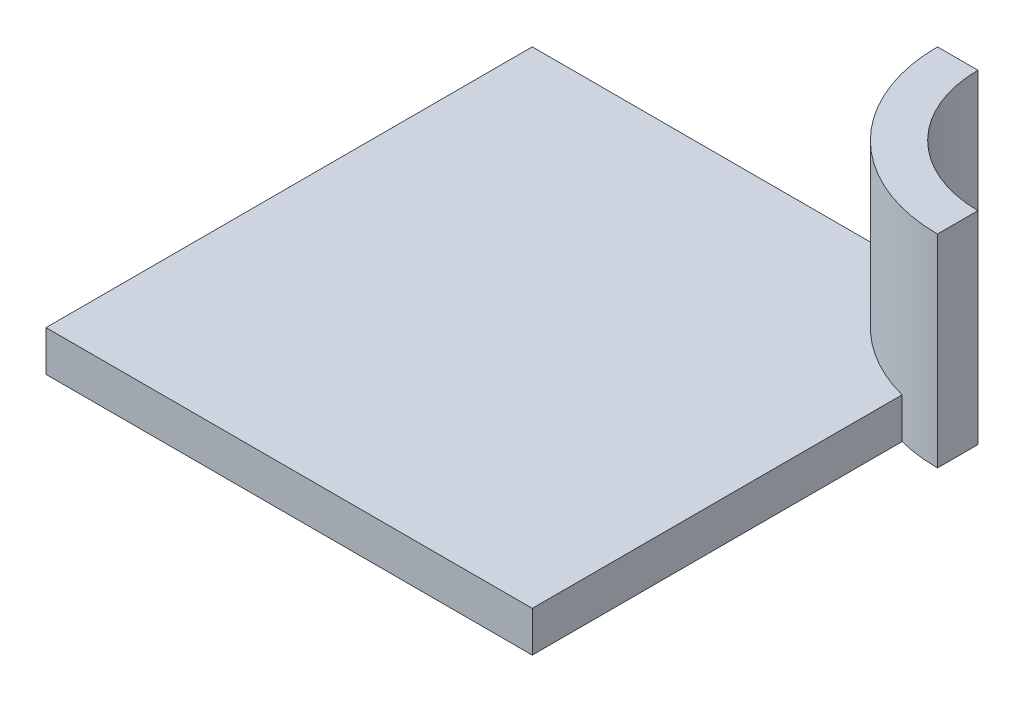
ISO-10303-21;
HEADER;
FILE_DESCRIPTION(('STEP AP214'),'2;1');
FILE_NAME('part.step','',(''),(''),'','','');
FILE_SCHEMA(('AUTOMOTIVE_DESIGN { 1 0 10303 214 1 1 1 1 }'));
ENDSEC;
DATA;
#1=APPLICATION_CONTEXT('core data for automotive mechanical design processes');
#2=APPLICATION_PROTOCOL_DEFINITION('international standard','automotive_design',2000,#1);
#3=PRODUCT_CONTEXT('',#1,'mechanical');
#4=PRODUCT('Part','Part','',(#3));
#5=PRODUCT_RELATED_PRODUCT_CATEGORY('part','',(#4));
#6=PRODUCT_DEFINITION_FORMATION('','',#4);
#7=PRODUCT_DEFINITION_CONTEXT('part definition',#1,'design');
#8=PRODUCT_DEFINITION('design','',#6,#7);
#9=PRODUCT_DEFINITION_SHAPE('','',#8);
#10=(LENGTH_UNIT() NAMED_UNIT(*) SI_UNIT(.MILLI.,.METRE.));
#11=(NAMED_UNIT(*) PLANE_ANGLE_UNIT() SI_UNIT($,.RADIAN.));
#12=(NAMED_UNIT(*) SI_UNIT($,.STERADIAN.) SOLID_ANGLE_UNIT());
#13=UNCERTAINTY_MEASURE_WITH_UNIT(LENGTH_MEASURE(1.E-05),#10,'distance_accuracy_value','');
#14=(GEOMETRIC_REPRESENTATION_CONTEXT(3) GLOBAL_UNCERTAINTY_ASSIGNED_CONTEXT((#13)) GLOBAL_UNIT_ASSIGNED_CONTEXT((#10,
#11,#12)) REPRESENTATION_CONTEXT('',''));
#15=CARTESIAN_POINT('',(0.,0.,0.));
#16=DIRECTION('',(0.,0.,1.));
#17=DIRECTION('',(1.,0.,0.));
#18=AXIS2_PLACEMENT_3D('',#15,#16,#17);
#19=CARTESIAN_POINT('',(1.25,-0.05,-1.));
#20=DIRECTION('',(0.,1.,0.));
#21=DIRECTION('',(0.,0.,-1.));
#22=AXIS2_PLACEMENT_3D('',#19,#20,#21);
#23=CYLINDRICAL_SURFACE('',#22,0.2);
#24=DIRECTION('',(0.,1.,0.));
#25=VECTOR('',#24,1.);
#26=CARTESIAN_POINT('',(1.05635083268963,-0.898528137423858,-0.95));
#27=LINE('',#26,#25);
#28=CARTESIAN_POINT('',(1.05635083268963,-0.05,-0.95));
#29=VERTEX_POINT('',#28);
#30=CARTESIAN_POINT('',(1.05635083268963,0.,-0.95));
#31=VERTEX_POINT('',#30);
#32=EDGE_CURVE('E11',#29,#31,#27,.T.);
#33=ORIENTED_EDGE('',*,*,#32,.T.);
#34=CARTESIAN_POINT('',(1.25,0.,-1.));
#35=DIRECTION('',(0.,-1.,0.));
#36=DIRECTION('',(0.,0.,1.));
#37=AXIS2_PLACEMENT_3D('',#34,#35,#36);
#38=CIRCLE('',#37,0.2);
#39=CARTESIAN_POINT('',(1.2,0.,-0.806350832689629));
#40=VERTEX_POINT('',#39);
#41=EDGE_CURVE('E24',#40,#31,#38,.T.);
#42=ORIENTED_EDGE('',*,*,#41,.F.);
#43=DIRECTION('',(0.,1.,0.));
#44=VECTOR('',#43,1.);
#45=CARTESIAN_POINT('',(1.2,-0.898528137423858,-0.806350832689629));
#46=LINE('',#45,#44);
#47=CARTESIAN_POINT('',(1.2,-0.05,-0.806350832689629));
#48=VERTEX_POINT('',#47);
#49=EDGE_CURVE('E106',#48,#40,#46,.T.);
#50=ORIENTED_EDGE('',*,*,#49,.F.);
#51=CARTESIAN_POINT('',(1.25,-0.05,-1.));
#52=DIRECTION('',(0.,1.,0.));
#53=DIRECTION('',(0.,0.,1.));
#54=AXIS2_PLACEMENT_3D('',#51,#52,#53);
#55=CIRCLE('',#54,0.2);
#56=CARTESIAN_POINT('',(1.25,-0.05,-0.8));
#57=VERTEX_POINT('',#56);
#58=EDGE_CURVE('E157',#48,#57,#55,.T.);
#59=ORIENTED_EDGE('',*,*,#58,.T.);
#60=DIRECTION('',(0.,1.,0.));
#61=VECTOR('',#60,1.);
#62=CARTESIAN_POINT('',(1.25,-0.05,-0.8));
#63=LINE('',#62,#61);
#64=CARTESIAN_POINT('',(1.25,0.2,-0.8));
#65=VERTEX_POINT('',#64);
#66=EDGE_CURVE('E155',#57,#65,#63,.T.);
#67=ORIENTED_EDGE('',*,*,#66,.T.);
#68=CARTESIAN_POINT('',(1.25,0.2,-1.));
#69=DIRECTION('',(0.,1.,0.));
#70=DIRECTION('',(0.,0.,1.));
#71=AXIS2_PLACEMENT_3D('',#68,#69,#70);
#72=CIRCLE('',#71,0.2);
#73=CARTESIAN_POINT('',(1.05,0.2,-1.));
#74=VERTEX_POINT('',#73);
#75=EDGE_CURVE('E152',#74,#65,#72,.T.);
#76=ORIENTED_EDGE('',*,*,#75,.F.);
#77=DIRECTION('',(0.,1.,0.));
#78=VECTOR('',#77,1.);
#79=CARTESIAN_POINT('',(1.05,-0.05,-1.));
#80=LINE('',#79,#78);
#81=CARTESIAN_POINT('',(1.05,-0.05,-1.));
#82=VERTEX_POINT('',#81);
#83=EDGE_CURVE('E149',#82,#74,#80,.T.);
#84=ORIENTED_EDGE('',*,*,#83,.F.);
#85=CARTESIAN_POINT('',(1.25,-0.05,-1.));
#86=DIRECTION('',(0.,1.,0.));
#87=DIRECTION('',(0.,0.,1.));
#88=AXIS2_PLACEMENT_3D('',#85,#86,#87);
#89=CIRCLE('',#88,0.2);
#90=EDGE_CURVE('E147',#82,#29,#89,.T.);
#91=ORIENTED_EDGE('',*,*,#90,.T.);
#92=EDGE_LOOP('',(#33,#42,#50,#59,#67,#76,#84,#91));
#93=FACE_BOUND('',#92,.T.);
#94=ADVANCED_FACE('F17',(#93),#23,.T.);
#95=CARTESIAN_POINT('',(1.25,-0.05,-1.));
#96=DIRECTION('',(0.,1.,0.));
#97=DIRECTION('',(0.,0.,-1.));
#98=AXIS2_PLACEMENT_3D('',#95,#96,#97);
#99=CYLINDRICAL_SURFACE('',#98,0.15);
#100=DIRECTION('',(0.,1.,0.));
#101=VECTOR('',#100,1.);
#102=CARTESIAN_POINT('',(1.25,-0.05,-0.85));
#103=LINE('',#102,#101);
#104=CARTESIAN_POINT('',(1.25,-0.05,-0.85));
#105=VERTEX_POINT('',#104);
#106=CARTESIAN_POINT('',(1.25,0.2,-0.85));
#107=VERTEX_POINT('',#106);
#108=EDGE_CURVE('E144',#105,#107,#103,.T.);
#109=ORIENTED_EDGE('',*,*,#108,.F.);
#110=CARTESIAN_POINT('',(1.25,-0.05,-1.));
#111=DIRECTION('',(0.,-1.,0.));
#112=DIRECTION('',(0.,0.,1.));
#113=AXIS2_PLACEMENT_3D('',#110,#111,#112);
#114=CIRCLE('',#113,0.15);
#115=CARTESIAN_POINT('',(1.1,-0.05,-1.));
#116=VERTEX_POINT('',#115);
#117=EDGE_CURVE('E141',#105,#116,#114,.T.);
#118=ORIENTED_EDGE('',*,*,#117,.T.);
#119=DIRECTION('',(0.,1.,0.));
#120=VECTOR('',#119,1.);
#121=CARTESIAN_POINT('',(1.1,-0.05,-1.));
#122=LINE('',#121,#120);
#123=CARTESIAN_POINT('',(1.1,0.2,-1.));
#124=VERTEX_POINT('',#123);
#125=EDGE_CURVE('E138',#116,#124,#122,.T.);
#126=ORIENTED_EDGE('',*,*,#125,.T.);
#127=CARTESIAN_POINT('',(1.25,0.2,-1.));
#128=DIRECTION('',(0.,-1.,0.));
#129=DIRECTION('',(0.,0.,1.));
#130=AXIS2_PLACEMENT_3D('',#127,#128,#129);
#131=CIRCLE('',#130,0.15);
#132=EDGE_CURVE('E136',#107,#124,#131,.T.);
#133=ORIENTED_EDGE('',*,*,#132,.F.);
#134=EDGE_LOOP('',(#109,#118,#126,#133));
#135=FACE_BOUND('',#134,.T.);
#136=ADVANCED_FACE('F181',(#135),#99,.F.);
#137=CARTESIAN_POINT('',(1.05,-0.05,-1.));
#138=DIRECTION('',(0.,0.,1.));
#139=DIRECTION('',(-1.,0.,0.));
#140=AXIS2_PLACEMENT_3D('',#137,#138,#139);
#141=PLANE('',#140);
#142=ORIENTED_EDGE('',*,*,#125,.F.);
#143=DIRECTION('',(-1.,0.,0.));
#144=VECTOR('',#143,1.);
#145=CARTESIAN_POINT('',(1.05,-0.05,-1.));
#146=LINE('',#145,#144);
#147=EDGE_CURVE('E133',#116,#82,#146,.T.);
#148=ORIENTED_EDGE('',*,*,#147,.T.);
#149=ORIENTED_EDGE('',*,*,#83,.T.);
#150=DIRECTION('',(-1.,0.,0.));
#151=VECTOR('',#150,1.);
#152=CARTESIAN_POINT('',(1.05,0.2,-1.));
#153=LINE('',#152,#151);
#154=EDGE_CURVE('E130',#124,#74,#153,.T.);
#155=ORIENTED_EDGE('',*,*,#154,.F.);
#156=EDGE_LOOP('',(#142,#148,#149,#155));
#157=FACE_BOUND('',#156,.T.);
#158=ADVANCED_FACE('F178',(#157),#141,.F.);
#159=CARTESIAN_POINT('',(1.25,-0.05,-0.85));
#160=DIRECTION('',(-1.,0.,0.));
#161=DIRECTION('',(0.,0.,-1.));
#162=AXIS2_PLACEMENT_3D('',#159,#160,#161);
#163=PLANE('',#162);
#164=ORIENTED_EDGE('',*,*,#66,.F.);
#165=DIRECTION('',(0.,0.,-1.));
#166=VECTOR('',#165,1.);
#167=CARTESIAN_POINT('',(1.25,-0.05,-0.85));
#168=LINE('',#167,#166);
#169=EDGE_CURVE('E127',#57,#105,#168,.T.);
#170=ORIENTED_EDGE('',*,*,#169,.T.);
#171=ORIENTED_EDGE('',*,*,#108,.T.);
#172=DIRECTION('',(0.,0.,-1.));
#173=VECTOR('',#172,1.);
#174=CARTESIAN_POINT('',(1.25,0.2,-0.85));
#175=LINE('',#174,#173);
#176=EDGE_CURVE('E124',#65,#107,#175,.T.);
#177=ORIENTED_EDGE('',*,*,#176,.F.);
#178=EDGE_LOOP('',(#164,#170,#171,#177));
#179=FACE_BOUND('',#178,.T.);
#180=ADVANCED_FACE('F172',(#179),#163,.F.);
#181=CARTESIAN_POINT('',(1.25,-0.05,-1.));
#182=DIRECTION('',(0.,-1.,0.));
#183=DIRECTION('',(0.,0.,1.));
#184=AXIS2_PLACEMENT_3D('',#181,#182,#183);
#185=PLANE('',#184);
#186=ORIENTED_EDGE('',*,*,#117,.F.);
#187=ORIENTED_EDGE('',*,*,#169,.F.);
#188=ORIENTED_EDGE('',*,*,#58,.F.);
#189=DIRECTION('',(0.,0.,-1.));
#190=VECTOR('',#189,1.);
#191=CARTESIAN_POINT('',(1.2,-0.05,-0.35));
#192=LINE('',#191,#190);
#193=CARTESIAN_POINT('',(1.2,-0.05,-0.35));
#194=VERTEX_POINT('',#193);
#195=EDGE_CURVE('E122',#194,#48,#192,.T.);
#196=ORIENTED_EDGE('',*,*,#195,.F.);
#197=DIRECTION('',(1.,0.,0.));
#198=VECTOR('',#197,1.);
#199=CARTESIAN_POINT('',(0.6,-0.05,-0.35));
#200=LINE('',#199,#198);
#201=CARTESIAN_POINT('',(0.6,-0.05,-0.35));
#202=VERTEX_POINT('',#201);
#203=EDGE_CURVE('E90',#202,#194,#200,.T.);
#204=ORIENTED_EDGE('',*,*,#203,.F.);
#205=DIRECTION('',(0.,0.,1.));
#206=VECTOR('',#205,1.);
#207=CARTESIAN_POINT('',(0.6,-0.05,-0.95));
#208=LINE('',#207,#206);
#209=CARTESIAN_POINT('',(0.6,-0.05,-0.95));
#210=VERTEX_POINT('',#209);
#211=EDGE_CURVE('E118',#210,#202,#208,.T.);
#212=ORIENTED_EDGE('',*,*,#211,.F.);
#213=DIRECTION('',(-1.,0.,0.));
#214=VECTOR('',#213,1.);
#215=CARTESIAN_POINT('',(1.05635083268963,-0.05,-0.95));
#216=LINE('',#215,#214);
#217=EDGE_CURVE('E116',#29,#210,#216,.T.);
#218=ORIENTED_EDGE('',*,*,#217,.F.);
#219=ORIENTED_EDGE('',*,*,#90,.F.);
#220=ORIENTED_EDGE('',*,*,#147,.F.);
#221=EDGE_LOOP('',(#186,#187,#188,#196,#204,#212,#218,#219,#220));
#222=FACE_BOUND('',#221,.T.);
#223=ADVANCED_FACE('F165',(#222),#185,.T.);
#224=CARTESIAN_POINT('',(1.25,0.2,-1.));
#225=DIRECTION('',(0.,-1.,0.));
#226=DIRECTION('',(0.,0.,1.));
#227=AXIS2_PLACEMENT_3D('',#224,#225,#226);
#228=PLANE('',#227);
#229=ORIENTED_EDGE('',*,*,#132,.T.);
#230=ORIENTED_EDGE('',*,*,#154,.T.);
#231=ORIENTED_EDGE('',*,*,#75,.T.);
#232=ORIENTED_EDGE('',*,*,#176,.T.);
#233=EDGE_LOOP('',(#229,#230,#231,#232));
#234=FACE_BOUND('',#233,.T.);
#235=ADVANCED_FACE('F175',(#234),#228,.F.);
#236=CARTESIAN_POINT('',(1.05635083268963,-0.898528137423858,-0.95));
#237=DIRECTION('',(0.,0.,1.));
#238=DIRECTION('',(-1.,0.,0.));
#239=AXIS2_PLACEMENT_3D('',#236,#237,#238);
#240=PLANE('',#239);
#241=ORIENTED_EDGE('',*,*,#217,.T.);
#242=DIRECTION('',(0.,1.,0.));
#243=VECTOR('',#242,1.);
#244=CARTESIAN_POINT('',(0.6,-0.898528137423858,-0.95));
#245=LINE('',#244,#243);
#246=CARTESIAN_POINT('',(0.6,0.,-0.95));
#247=VERTEX_POINT('',#246);
#248=EDGE_CURVE('E114',#210,#247,#245,.T.);
#249=ORIENTED_EDGE('',*,*,#248,.T.);
#250=DIRECTION('',(-1.,0.,0.));
#251=VECTOR('',#250,1.);
#252=CARTESIAN_POINT('',(1.05635083268963,0.,-0.95));
#253=LINE('',#252,#251);
#254=EDGE_CURVE('E112',#31,#247,#253,.T.);
#255=ORIENTED_EDGE('',*,*,#254,.F.);
#256=ORIENTED_EDGE('',*,*,#32,.F.);
#257=EDGE_LOOP('',(#241,#249,#255,#256));
#258=FACE_BOUND('',#257,.T.);
#259=ADVANCED_FACE('F159',(#258),#240,.F.);
#260=CARTESIAN_POINT('',(0.6,-0.898528137423858,-0.95));
#261=DIRECTION('',(1.,0.,0.));
#262=DIRECTION('',(0.,0.,1.));
#263=AXIS2_PLACEMENT_3D('',#260,#261,#262);
#264=PLANE('',#263);
#265=ORIENTED_EDGE('',*,*,#211,.T.);
#266=DIRECTION('',(0.,1.,0.));
#267=VECTOR('',#266,1.);
#268=CARTESIAN_POINT('',(0.6,-0.898528137423858,-0.35));
#269=LINE('',#268,#267);
#270=CARTESIAN_POINT('',(0.6,0.,-0.35));
#271=VERTEX_POINT('',#270);
#272=EDGE_CURVE('E110',#202,#271,#269,.T.);
#273=ORIENTED_EDGE('',*,*,#272,.T.);
#274=DIRECTION('',(0.,0.,1.));
#275=VECTOR('',#274,1.);
#276=CARTESIAN_POINT('',(0.6,0.,-0.95));
#277=LINE('',#276,#275);
#278=EDGE_CURVE('E94',#247,#271,#277,.T.);
#279=ORIENTED_EDGE('',*,*,#278,.F.);
#280=ORIENTED_EDGE('',*,*,#248,.F.);
#281=EDGE_LOOP('',(#265,#273,#279,#280));
#282=FACE_BOUND('',#281,.T.);
#283=ADVANCED_FACE('F163',(#282),#264,.F.);
#284=CARTESIAN_POINT('',(0.6,-0.898528137423858,-0.35));
#285=DIRECTION('',(0.,0.,-1.));
#286=DIRECTION('',(1.,0.,0.));
#287=AXIS2_PLACEMENT_3D('',#284,#285,#286);
#288=PLANE('',#287);
#289=ORIENTED_EDGE('',*,*,#203,.T.);
#290=DIRECTION('',(0.,1.,0.));
#291=VECTOR('',#290,1.);
#292=CARTESIAN_POINT('',(1.2,-0.898528137423858,-0.35));
#293=LINE('',#292,#291);
#294=CARTESIAN_POINT('',(1.2,0.,-0.35));
#295=VERTEX_POINT('',#294);
#296=EDGE_CURVE('E85',#194,#295,#293,.T.);
#297=ORIENTED_EDGE('',*,*,#296,.T.);
#298=DIRECTION('',(1.,0.,0.));
#299=VECTOR('',#298,1.);
#300=CARTESIAN_POINT('',(0.6,0.,-0.35));
#301=LINE('',#300,#299);
#302=EDGE_CURVE('E89',#271,#295,#301,.T.);
#303=ORIENTED_EDGE('',*,*,#302,.F.);
#304=ORIENTED_EDGE('',*,*,#272,.F.);
#305=EDGE_LOOP('',(#289,#297,#303,#304));
#306=FACE_BOUND('',#305,.T.);
#307=ADVANCED_FACE('F87',(#306),#288,.F.);
#308=CARTESIAN_POINT('',(1.2,-0.898528137423858,-0.35));
#309=DIRECTION('',(-1.,0.,0.));
#310=DIRECTION('',(0.,0.,-1.));
#311=AXIS2_PLACEMENT_3D('',#308,#309,#310);
#312=PLANE('',#311);
#313=ORIENTED_EDGE('',*,*,#195,.T.);
#314=ORIENTED_EDGE('',*,*,#49,.T.);
#315=DIRECTION('',(0.,0.,-1.));
#316=VECTOR('',#315,1.);
#317=CARTESIAN_POINT('',(1.2,0.,-0.35));
#318=LINE('',#317,#316);
#319=EDGE_CURVE('E100',#295,#40,#318,.T.);
#320=ORIENTED_EDGE('',*,*,#319,.F.);
#321=ORIENTED_EDGE('',*,*,#296,.F.);
#322=EDGE_LOOP('',(#313,#314,#320,#321));
#323=FACE_BOUND('',#322,.T.);
#324=ADVANCED_FACE('F105',(#323),#312,.F.);
#325=CARTESIAN_POINT('',(1.25,0.,-1.));
#326=DIRECTION('',(0.,-1.,0.));
#327=DIRECTION('',(0.,0.,1.));
#328=AXIS2_PLACEMENT_3D('',#325,#326,#327);
#329=PLANE('',#328);
#330=ORIENTED_EDGE('',*,*,#41,.T.);
#331=ORIENTED_EDGE('',*,*,#254,.T.);
#332=ORIENTED_EDGE('',*,*,#278,.T.);
#333=ORIENTED_EDGE('',*,*,#302,.T.);
#334=ORIENTED_EDGE('',*,*,#319,.T.);
#335=EDGE_LOOP('',(#330,#331,#332,#333,#334));
#336=FACE_BOUND('',#335,.T.);
#337=ADVANCED_FACE('F99',(#336),#329,.F.);
#338=CLOSED_SHELL('',(#94,#136,#158,#180,#223,#235,#259,#283,#307,#324,#337));
#339=MANIFOLD_SOLID_BREP('B1',#338);
#340=ADVANCED_BREP_SHAPE_REPRESENTATION('',(#18,#339),#14);
#341=SHAPE_DEFINITION_REPRESENTATION(#9,#340);
ENDSEC;
END-ISO-10303-21;
